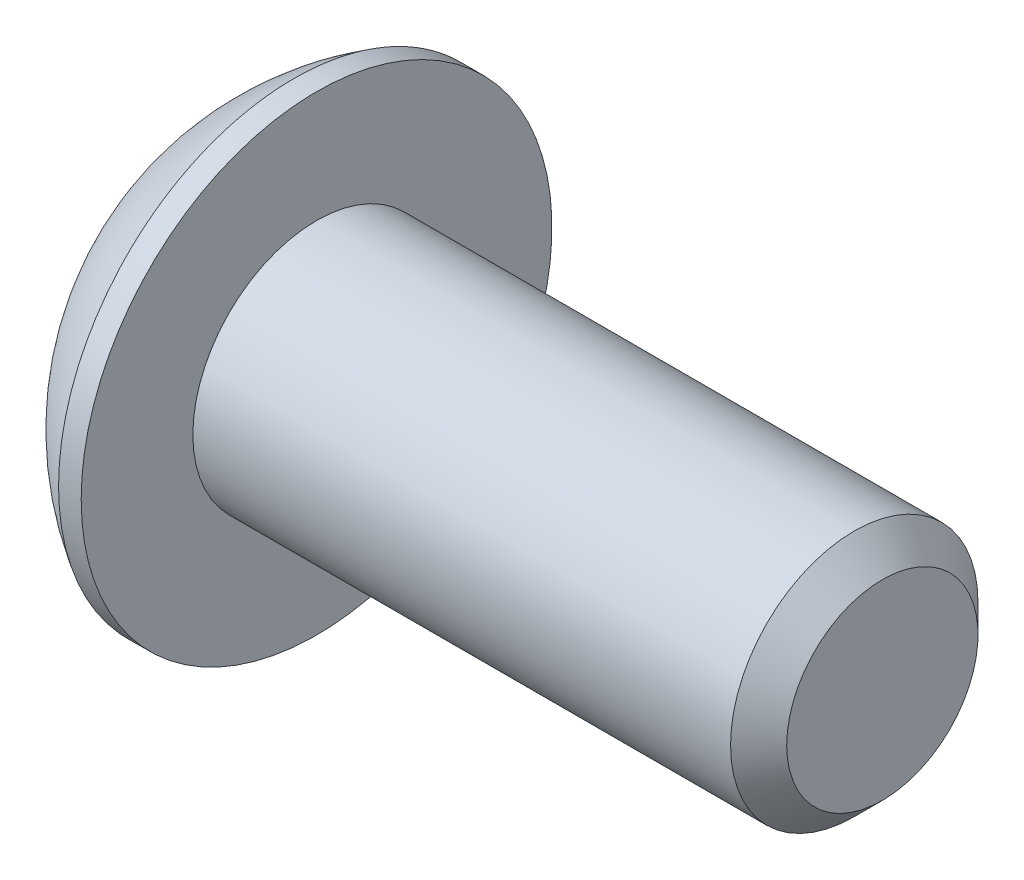
ISO-10303-21;
HEADER;
FILE_DESCRIPTION(('STEP AP214'),'2;1');
FILE_NAME('part.step','',(''),(''),'','','');
FILE_SCHEMA(('AUTOMOTIVE_DESIGN { 1 0 10303 214 1 1 1 1 }'));
ENDSEC;
DATA;
#1=APPLICATION_CONTEXT('core data for automotive mechanical design processes');
#2=APPLICATION_PROTOCOL_DEFINITION('international standard','automotive_design',2000,#1);
#3=PRODUCT_CONTEXT('',#1,'mechanical');
#4=PRODUCT('Part','Part','',(#3));
#5=PRODUCT_RELATED_PRODUCT_CATEGORY('part','',(#4));
#6=PRODUCT_DEFINITION_FORMATION('','',#4);
#7=PRODUCT_DEFINITION_CONTEXT('part definition',#1,'design');
#8=PRODUCT_DEFINITION('design','',#6,#7);
#9=PRODUCT_DEFINITION_SHAPE('','',#8);
#10=(LENGTH_UNIT() NAMED_UNIT(*) SI_UNIT(.MILLI.,.METRE.));
#11=(NAMED_UNIT(*) PLANE_ANGLE_UNIT() SI_UNIT($,.RADIAN.));
#12=(NAMED_UNIT(*) SI_UNIT($,.STERADIAN.) SOLID_ANGLE_UNIT());
#13=UNCERTAINTY_MEASURE_WITH_UNIT(LENGTH_MEASURE(1.E-05),#10,'distance_accuracy_value','');
#14=(GEOMETRIC_REPRESENTATION_CONTEXT(3) GLOBAL_UNCERTAINTY_ASSIGNED_CONTEXT((#13)) GLOBAL_UNIT_ASSIGNED_CONTEXT((#10,
#11,#12)) REPRESENTATION_CONTEXT('',''));
#15=CARTESIAN_POINT('',(0.,0.,0.));
#16=DIRECTION('',(0.,0.,1.));
#17=DIRECTION('',(1.,0.,0.));
#18=AXIS2_PLACEMENT_3D('',#15,#16,#17);
#19=CARTESIAN_POINT('',(1.32080000000034,0.,0.));
#20=DIRECTION('',(-1.,0.,0.));
#21=DIRECTION('',(0.,0.,1.));
#22=AXIS2_PLACEMENT_3D('',#19,#20,#21);
#23=CONICAL_SURFACE('',#22,1.1937999999998,1.04719755119608);
#24=CARTESIAN_POINT('',(2.01004075135902,0.,4.44089209850063E-13));
#25=VERTEX_POINT('',#24);
#26=VERTEX_LOOP('',#25);
#27=FACE_BOUND('',#26,.T.);
#28=CARTESIAN_POINT('',(1.32080000000009,0.,0.));
#29=DIRECTION('',(-1.,0.,0.));
#30=DIRECTION('',(0.,0.,1.));
#31=AXIS2_PLACEMENT_3D('',#28,#29,#30);
#32=CIRCLE('',#31,1.19380000000024);
#33=CARTESIAN_POINT('',(1.32080000000004,-1.03386112703797,0.59690000000006));
#34=VERTEX_POINT('',#33);
#35=CARTESIAN_POINT('',(1.32080000000004,0.,1.19380000000012));
#36=VERTEX_POINT('',#35);
#37=EDGE_CURVE('E19',#34,#36,#32,.T.);
#38=ORIENTED_EDGE('',*,*,#37,.T.);
#39=CARTESIAN_POINT('',(1.32080000000009,0.,0.));
#40=DIRECTION('',(-1.,0.,0.));
#41=DIRECTION('',(0.,0.,1.));
#42=AXIS2_PLACEMENT_3D('',#39,#40,#41);
#43=CIRCLE('',#42,1.19380000000024);
#44=CARTESIAN_POINT('',(1.32080000000004,1.03386112703797,0.596900000000061));
#45=VERTEX_POINT('',#44);
#46=EDGE_CURVE('E147',#36,#45,#43,.T.);
#47=ORIENTED_EDGE('',*,*,#46,.T.);
#48=CARTESIAN_POINT('',(1.32080000000009,0.,0.));
#49=DIRECTION('',(-1.,0.,0.));
#50=DIRECTION('',(0.,0.,1.));
#51=AXIS2_PLACEMENT_3D('',#48,#49,#50);
#52=CIRCLE('',#51,1.19380000000024);
#53=CARTESIAN_POINT('',(1.32080000000004,1.03386112703797,-0.596900000000061));
#54=VERTEX_POINT('',#53);
#55=EDGE_CURVE('E317',#45,#54,#52,.T.);
#56=ORIENTED_EDGE('',*,*,#55,.T.);
#57=CARTESIAN_POINT('',(1.32080000000009,0.,0.));
#58=DIRECTION('',(-1.,0.,0.));
#59=DIRECTION('',(0.,0.,1.));
#60=AXIS2_PLACEMENT_3D('',#57,#58,#59);
#61=CIRCLE('',#60,1.19380000000024);
#62=CARTESIAN_POINT('',(1.32080000000004,1.49457637585666E-12,-1.19380000000012));
#63=VERTEX_POINT('',#62);
#64=EDGE_CURVE('E318',#54,#63,#61,.T.);
#65=ORIENTED_EDGE('',*,*,#64,.T.);
#66=CARTESIAN_POINT('',(1.32080000000009,0.,0.));
#67=DIRECTION('',(-1.,0.,0.));
#68=DIRECTION('',(0.,0.,1.));
#69=AXIS2_PLACEMENT_3D('',#66,#67,#68);
#70=CIRCLE('',#69,1.19380000000024);
#71=CARTESIAN_POINT('',(1.32080000000004,-1.03386112703797,-0.59690000000006));
#72=VERTEX_POINT('',#71);
#73=EDGE_CURVE('E92',#63,#72,#70,.T.);
#74=ORIENTED_EDGE('',*,*,#73,.T.);
#75=CARTESIAN_POINT('',(1.32080000000009,0.,0.));
#76=DIRECTION('',(-1.,0.,0.));
#77=DIRECTION('',(0.,0.,1.));
#78=AXIS2_PLACEMENT_3D('',#75,#76,#77);
#79=CIRCLE('',#78,1.19380000000024);
#80=EDGE_CURVE('E88',#72,#34,#79,.T.);
#81=ORIENTED_EDGE('',*,*,#80,.T.);
#82=EDGE_LOOP('',(#38,#47,#56,#65,#74,#81));
#83=FACE_BOUND('',#82,.T.);
#84=ADVANCED_FACE('F16',(#27,#83),#23,.F.);
#85=CARTESIAN_POINT('',(1.3208,-2.06772225407572,-1.1938));
#86=DIRECTION('',(1.,0.,0.));
#87=DIRECTION('',(0.,0.,-1.));
#88=AXIS2_PLACEMENT_3D('',#85,#86,#87);
#89=PLANE('',#88);
#90=DIRECTION('',(0.,0.5,0.866025403784439));
#91=VECTOR('',#90,1.);
#92=CARTESIAN_POINT('',(1.3208,-1.37848150271715,0.));
#93=LINE('',#92,#91);
#94=CARTESIAN_POINT('',(1.3208,-0.689240751358574,1.1938));
#95=VERTEX_POINT('',#94);
#96=EDGE_CURVE('E100',#95,#34,#93,.F.);
#97=ORIENTED_EDGE('',*,*,#96,.F.);
#98=DIRECTION('',(0.,1.,0.));
#99=VECTOR('',#98,1.);
#100=CARTESIAN_POINT('',(1.3208,-0.689240751358574,1.1938));
#101=LINE('',#100,#99);
#102=EDGE_CURVE('E102',#36,#95,#101,.F.);
#103=ORIENTED_EDGE('',*,*,#102,.F.);
#104=ORIENTED_EDGE('',*,*,#37,.F.);
#105=EDGE_LOOP('',(#97,#103,#104));
#106=FACE_BOUND('',#105,.T.);
#107=ADVANCED_FACE('F98',(#106),#89,.F.);
#108=CARTESIAN_POINT('',(1.3208,-2.06772225407572,-1.1938));
#109=DIRECTION('',(1.,0.,0.));
#110=DIRECTION('',(0.,0.,-1.));
#111=AXIS2_PLACEMENT_3D('',#108,#109,#110);
#112=PLANE('',#111);
#113=DIRECTION('',(0.,-0.5,0.866025403784439));
#114=VECTOR('',#113,1.);
#115=CARTESIAN_POINT('',(1.3208,-0.689240751358574,-1.1938));
#116=LINE('',#115,#114);
#117=CARTESIAN_POINT('',(1.3208,-1.37848150271715,0.));
#118=VERTEX_POINT('',#117);
#119=EDGE_CURVE('E108',#118,#72,#116,.F.);
#120=ORIENTED_EDGE('',*,*,#119,.F.);
#121=DIRECTION('',(0.,0.5,0.866025403784439));
#122=VECTOR('',#121,1.);
#123=CARTESIAN_POINT('',(1.3208,-1.37848150271715,0.));
#124=LINE('',#123,#122);
#125=EDGE_CURVE('E105',#34,#118,#124,.F.);
#126=ORIENTED_EDGE('',*,*,#125,.F.);
#127=ORIENTED_EDGE('',*,*,#80,.F.);
#128=EDGE_LOOP('',(#120,#126,#127));
#129=FACE_BOUND('',#128,.T.);
#130=ADVANCED_FACE('F106',(#129),#112,.F.);
#131=CARTESIAN_POINT('',(1.3208,-2.06772225407572,-1.1938));
#132=DIRECTION('',(1.,0.,0.));
#133=DIRECTION('',(0.,0.,-1.));
#134=AXIS2_PLACEMENT_3D('',#131,#132,#133);
#135=PLANE('',#134);
#136=DIRECTION('',(0.,1.,0.));
#137=VECTOR('',#136,1.);
#138=CARTESIAN_POINT('',(1.3208,0.689240751358577,-1.1938));
#139=LINE('',#138,#137);
#140=CARTESIAN_POINT('',(1.3208,-0.689240751358574,-1.1938));
#141=VERTEX_POINT('',#140);
#142=EDGE_CURVE('E287',#141,#63,#139,.T.);
#143=ORIENTED_EDGE('',*,*,#142,.F.);
#144=DIRECTION('',(0.,-0.5,0.866025403784439));
#145=VECTOR('',#144,1.);
#146=CARTESIAN_POINT('',(1.3208,-0.689240751358574,-1.1938));
#147=LINE('',#146,#145);
#148=EDGE_CURVE('E299',#72,#141,#147,.F.);
#149=ORIENTED_EDGE('',*,*,#148,.F.);
#150=ORIENTED_EDGE('',*,*,#73,.F.);
#151=EDGE_LOOP('',(#143,#149,#150));
#152=FACE_BOUND('',#151,.T.);
#153=ADVANCED_FACE('F190',(#152),#135,.F.);
#154=CARTESIAN_POINT('',(1.3208,-2.06772225407572,-1.1938));
#155=DIRECTION('',(1.,0.,0.));
#156=DIRECTION('',(0.,0.,-1.));
#157=AXIS2_PLACEMENT_3D('',#154,#155,#156);
#158=PLANE('',#157);
#159=DIRECTION('',(0.,-0.5,-0.866025403784439));
#160=VECTOR('',#159,1.);
#161=CARTESIAN_POINT('',(1.3208,1.37848150271715,0.));
#162=LINE('',#161,#160);
#163=CARTESIAN_POINT('',(1.3208,0.689240751358577,-1.1938));
#164=VERTEX_POINT('',#163);
#165=EDGE_CURVE('E273',#164,#54,#162,.F.);
#166=ORIENTED_EDGE('',*,*,#165,.F.);
#167=DIRECTION('',(0.,1.,0.));
#168=VECTOR('',#167,1.);
#169=CARTESIAN_POINT('',(1.3208,0.689240751358577,-1.1938));
#170=LINE('',#169,#168);
#171=EDGE_CURVE('E284',#63,#164,#170,.T.);
#172=ORIENTED_EDGE('',*,*,#171,.F.);
#173=ORIENTED_EDGE('',*,*,#64,.F.);
#174=EDGE_LOOP('',(#166,#172,#173));
#175=FACE_BOUND('',#174,.T.);
#176=ADVANCED_FACE('F186',(#175),#158,.F.);
#177=CARTESIAN_POINT('',(1.3208,-2.06772225407572,-1.1938));
#178=DIRECTION('',(1.,0.,0.));
#179=DIRECTION('',(0.,0.,-1.));
#180=AXIS2_PLACEMENT_3D('',#177,#178,#179);
#181=PLANE('',#180);
#182=DIRECTION('',(0.,0.5,-0.866025403784439));
#183=VECTOR('',#182,1.);
#184=CARTESIAN_POINT('',(1.3208,0.689240751358576,1.1938));
#185=LINE('',#184,#183);
#186=CARTESIAN_POINT('',(1.3208,1.37848150271715,0.));
#187=VERTEX_POINT('',#186);
#188=EDGE_CURVE('E252',#187,#45,#185,.F.);
#189=ORIENTED_EDGE('',*,*,#188,.F.);
#190=DIRECTION('',(0.,-0.5,-0.866025403784439));
#191=VECTOR('',#190,1.);
#192=CARTESIAN_POINT('',(1.3208,1.37848150271715,0.));
#193=LINE('',#192,#191);
#194=EDGE_CURVE('E271',#54,#187,#193,.F.);
#195=ORIENTED_EDGE('',*,*,#194,.F.);
#196=ORIENTED_EDGE('',*,*,#55,.F.);
#197=EDGE_LOOP('',(#189,#195,#196));
#198=FACE_BOUND('',#197,.T.);
#199=ADVANCED_FACE('F182',(#198),#181,.F.);
#200=CARTESIAN_POINT('',(1.3208,-2.06772225407572,-1.1938));
#201=DIRECTION('',(1.,0.,0.));
#202=DIRECTION('',(0.,0.,-1.));
#203=AXIS2_PLACEMENT_3D('',#200,#201,#202);
#204=PLANE('',#203);
#205=DIRECTION('',(0.,1.,0.));
#206=VECTOR('',#205,1.);
#207=CARTESIAN_POINT('',(1.3208,-0.689240751358574,1.1938));
#208=LINE('',#207,#206);
#209=CARTESIAN_POINT('',(1.3208,0.689240751358576,1.1938));
#210=VERTEX_POINT('',#209);
#211=EDGE_CURVE('E117',#210,#36,#208,.F.);
#212=ORIENTED_EDGE('',*,*,#211,.F.);
#213=DIRECTION('',(0.,0.5,-0.866025403784439));
#214=VECTOR('',#213,1.);
#215=CARTESIAN_POINT('',(1.3208,0.689240751358576,1.1938));
#216=LINE('',#215,#214);
#217=EDGE_CURVE('E255',#45,#210,#216,.F.);
#218=ORIENTED_EDGE('',*,*,#217,.F.);
#219=ORIENTED_EDGE('',*,*,#46,.F.);
#220=EDGE_LOOP('',(#212,#218,#219));
#221=FACE_BOUND('',#220,.T.);
#222=ADVANCED_FACE('F178',(#221),#204,.F.);
#223=CARTESIAN_POINT('',(1.3208,-0.689240751358574,1.1938));
#224=DIRECTION('',(0.,0.,-1.));
#225=DIRECTION('',(0.,1.,0.));
#226=AXIS2_PLACEMENT_3D('',#223,#224,#225);
#227=PLANE('',#226);
#228=DIRECTION('',(0.,1.,0.));
#229=VECTOR('',#228,1.);
#230=CARTESIAN_POINT('',(0.,0.,1.1938));
#231=LINE('',#230,#229);
#232=CARTESIAN_POINT('',(0.,0.689240751358577,1.1938));
#233=VERTEX_POINT('',#232);
#234=CARTESIAN_POINT('',(0.,-0.689240751358574,1.1938));
#235=VERTEX_POINT('',#234);
#236=EDGE_CURVE('E249',#233,#235,#231,.F.);
#237=ORIENTED_EDGE('',*,*,#236,.F.);
#238=DIRECTION('',(1.,0.,0.));
#239=VECTOR('',#238,1.);
#240=CARTESIAN_POINT('',(1.3208,0.689240751358576,1.1938));
#241=LINE('',#240,#239);
#242=EDGE_CURVE('E261',#210,#233,#241,.F.);
#243=ORIENTED_EDGE('',*,*,#242,.F.);
#244=ORIENTED_EDGE('',*,*,#211,.T.);
#245=ORIENTED_EDGE('',*,*,#102,.T.);
#246=DIRECTION('',(1.,0.,0.));
#247=VECTOR('',#246,1.);
#248=CARTESIAN_POINT('',(1.3208,-0.689240751358574,1.1938));
#249=LINE('',#248,#247);
#250=EDGE_CURVE('E111',#235,#95,#249,.T.);
#251=ORIENTED_EDGE('',*,*,#250,.F.);
#252=EDGE_LOOP('',(#237,#243,#244,#245,#251));
#253=FACE_BOUND('',#252,.T.);
#254=ADVANCED_FACE('F175',(#253),#227,.T.);
#255=CARTESIAN_POINT('',(1.3208,-1.37848150271715,0.));
#256=DIRECTION('',(0.,0.866025403784439,-0.5));
#257=DIRECTION('',(0.,0.5,0.866025403784439));
#258=AXIS2_PLACEMENT_3D('',#255,#256,#257);
#259=PLANE('',#258);
#260=DIRECTION('',(0.,-0.5,-0.866025403784439));
#261=VECTOR('',#260,1.);
#262=CARTESIAN_POINT('',(0.,-0.689240751358574,1.1938));
#263=LINE('',#262,#261);
#264=CARTESIAN_POINT('',(0.,-1.37848150271715,0.));
#265=VERTEX_POINT('',#264);
#266=EDGE_CURVE('E246',#235,#265,#263,.T.);
#267=ORIENTED_EDGE('',*,*,#266,.F.);
#268=ORIENTED_EDGE('',*,*,#250,.T.);
#269=ORIENTED_EDGE('',*,*,#96,.T.);
#270=ORIENTED_EDGE('',*,*,#125,.T.);
#271=DIRECTION('',(1.,0.,0.));
#272=VECTOR('',#271,1.);
#273=CARTESIAN_POINT('',(1.3208,-1.37848150271715,0.));
#274=LINE('',#273,#272);
#275=EDGE_CURVE('E296',#265,#118,#274,.T.);
#276=ORIENTED_EDGE('',*,*,#275,.F.);
#277=EDGE_LOOP('',(#267,#268,#269,#270,#276));
#278=FACE_BOUND('',#277,.T.);
#279=ADVANCED_FACE('F115',(#278),#259,.T.);
#280=CARTESIAN_POINT('',(1.3208,-0.689240751358574,-1.1938));
#281=DIRECTION('',(0.,0.866025403784439,0.5));
#282=DIRECTION('',(0.,-0.5,0.866025403784439));
#283=AXIS2_PLACEMENT_3D('',#280,#281,#282);
#284=PLANE('',#283);
#285=DIRECTION('',(0.,0.5,-0.866025403784439));
#286=VECTOR('',#285,1.);
#287=CARTESIAN_POINT('',(0.,-1.37848150271715,0.));
#288=LINE('',#287,#286);
#289=CARTESIAN_POINT('',(0.,-0.689240751358574,-1.1938));
#290=VERTEX_POINT('',#289);
#291=EDGE_CURVE('E243',#265,#290,#288,.T.);
#292=ORIENTED_EDGE('',*,*,#291,.F.);
#293=ORIENTED_EDGE('',*,*,#275,.T.);
#294=ORIENTED_EDGE('',*,*,#119,.T.);
#295=ORIENTED_EDGE('',*,*,#148,.T.);
#296=DIRECTION('',(1.,0.,0.));
#297=VECTOR('',#296,1.);
#298=CARTESIAN_POINT('',(1.3208,-0.689240751358574,-1.1938));
#299=LINE('',#298,#297);
#300=EDGE_CURVE('E281',#290,#141,#299,.T.);
#301=ORIENTED_EDGE('',*,*,#300,.F.);
#302=EDGE_LOOP('',(#292,#293,#294,#295,#301));
#303=FACE_BOUND('',#302,.T.);
#304=ADVANCED_FACE('F168',(#303),#284,.T.);
#305=CARTESIAN_POINT('',(1.3208,0.689240751358577,-1.1938));
#306=DIRECTION('',(0.,0.,1.));
#307=DIRECTION('',(1.,0.,0.));
#308=AXIS2_PLACEMENT_3D('',#305,#306,#307);
#309=PLANE('',#308);
#310=DIRECTION('',(0.,1.,0.));
#311=VECTOR('',#310,1.);
#312=CARTESIAN_POINT('',(0.,0.,-1.1938));
#313=LINE('',#312,#311);
#314=CARTESIAN_POINT('',(0.,0.689240751358577,-1.1938));
#315=VERTEX_POINT('',#314);
#316=EDGE_CURVE('E240',#290,#315,#313,.T.);
#317=ORIENTED_EDGE('',*,*,#316,.F.);
#318=ORIENTED_EDGE('',*,*,#300,.T.);
#319=ORIENTED_EDGE('',*,*,#142,.T.);
#320=ORIENTED_EDGE('',*,*,#171,.T.);
#321=DIRECTION('',(1.,0.,0.));
#322=VECTOR('',#321,1.);
#323=CARTESIAN_POINT('',(1.3208,0.689240751358577,-1.1938));
#324=LINE('',#323,#322);
#325=EDGE_CURVE('E256',#315,#164,#324,.T.);
#326=ORIENTED_EDGE('',*,*,#325,.F.);
#327=EDGE_LOOP('',(#317,#318,#319,#320,#326));
#328=FACE_BOUND('',#327,.T.);
#329=ADVANCED_FACE('F165',(#328),#309,.T.);
#330=CARTESIAN_POINT('',(1.3208,1.37848150271715,0.));
#331=DIRECTION('',(0.,-0.866025403784439,0.5));
#332=DIRECTION('',(0.,-0.5,-0.866025403784439));
#333=AXIS2_PLACEMENT_3D('',#330,#331,#332);
#334=PLANE('',#333);
#335=DIRECTION('',(0.,0.5,0.866025403784439));
#336=VECTOR('',#335,1.);
#337=CARTESIAN_POINT('',(0.,0.689240751358577,-1.1938));
#338=LINE('',#337,#336);
#339=CARTESIAN_POINT('',(0.,1.37848150271715,0.));
#340=VERTEX_POINT('',#339);
#341=EDGE_CURVE('E237',#315,#340,#338,.T.);
#342=ORIENTED_EDGE('',*,*,#341,.F.);
#343=ORIENTED_EDGE('',*,*,#325,.T.);
#344=ORIENTED_EDGE('',*,*,#165,.T.);
#345=ORIENTED_EDGE('',*,*,#194,.T.);
#346=DIRECTION('',(1.,0.,0.));
#347=VECTOR('',#346,1.);
#348=CARTESIAN_POINT('',(1.3208,1.37848150271715,0.));
#349=LINE('',#348,#347);
#350=EDGE_CURVE('E34',#340,#187,#349,.T.);
#351=ORIENTED_EDGE('',*,*,#350,.F.);
#352=EDGE_LOOP('',(#342,#343,#344,#345,#351));
#353=FACE_BOUND('',#352,.T.);
#354=ADVANCED_FACE('F161',(#353),#334,.T.);
#355=CARTESIAN_POINT('',(1.3208,0.689240751358576,1.1938));
#356=DIRECTION('',(0.,-0.866025403784439,-0.5));
#357=DIRECTION('',(0.,0.5,-0.866025403784439));
#358=AXIS2_PLACEMENT_3D('',#355,#356,#357);
#359=PLANE('',#358);
#360=DIRECTION('',(0.,-0.5,0.866025403784439));
#361=VECTOR('',#360,1.);
#362=CARTESIAN_POINT('',(0.,1.37848150271715,0.));
#363=LINE('',#362,#361);
#364=EDGE_CURVE('E146',#340,#233,#363,.T.);
#365=ORIENTED_EDGE('',*,*,#364,.F.);
#366=ORIENTED_EDGE('',*,*,#350,.T.);
#367=ORIENTED_EDGE('',*,*,#188,.T.);
#368=ORIENTED_EDGE('',*,*,#217,.T.);
#369=ORIENTED_EDGE('',*,*,#242,.T.);
#370=EDGE_LOOP('',(#365,#366,#367,#368,#369));
#371=FACE_BOUND('',#370,.T.);
#372=ADVANCED_FACE('F157',(#371),#359,.T.);
#373=CARTESIAN_POINT('',(0.,0.,0.));
#374=DIRECTION('',(-1.,0.,0.));
#375=DIRECTION('',(0.,0.,1.));
#376=AXIS2_PLACEMENT_3D('',#373,#374,#375);
#377=PLANE('',#376);
#378=ORIENTED_EDGE('',*,*,#341,.T.);
#379=ORIENTED_EDGE('',*,*,#364,.T.);
#380=ORIENTED_EDGE('',*,*,#236,.T.);
#381=ORIENTED_EDGE('',*,*,#266,.T.);
#382=ORIENTED_EDGE('',*,*,#291,.T.);
#383=ORIENTED_EDGE('',*,*,#316,.T.);
#384=EDGE_LOOP('',(#378,#379,#380,#381,#382,#383));
#385=FACE_BOUND('',#384,.T.);
#386=CARTESIAN_POINT('',(0.,1.9812,0.));
#387=CARTESIAN_POINT('',(0.,1.9811996664299,0.0556258831179428));
#388=CARTESIAN_POINT('',(0.,1.97885520380442,0.111261989398606));
#389=CARTESIAN_POINT('',(0.,1.96949260169541,0.222149719830458));
#390=CARTESIAN_POINT('',(0.,1.96247308239605,0.277401225602895));
#391=CARTESIAN_POINT('',(0.,1.94379192841038,0.387209508139747));
#392=CARTESIAN_POINT('',(-1.85325793235264E-13,1.93212292489526,0.441765039546365));
#393=CARTESIAN_POINT('',(1.86344214223505E-13,1.90422331175315,0.549729449347493));
#394=CARTESIAN_POINT('',(6.94543371897454E-13,1.88798900035338,0.603137359208869));
#395=CARTESIAN_POINT('',(1.15501975216981E-12,1.83266214476501,0.760839131321828));
#396=CARTESIAN_POINT('',(0.,1.78690023648845,0.862876433575429));
#397=CARTESIAN_POINT('',(0.,1.67887358150667,1.05780719540872));
#398=CARTESIAN_POINT('',(9.54193214892627E-13,1.6166082074585,1.15070030720801));
#399=CARTESIAN_POINT('',(5.94805591894675E-13,1.51224157140982,1.28116890915697));
#400=CARTESIAN_POINT('',(1.63221293851378E-13,1.4755970394354,1.32320451127026));
#401=CARTESIAN_POINT('',(-1.62196980336157E-13,1.39893832619713,1.40400288695709));
#402=CARTESIAN_POINT('',(0.,1.35892742784698,1.44276877695455));
#403=CARTESIAN_POINT('',(1.14362537325405E-13,1.23416504602197,1.55382272417904));
#404=CARTESIAN_POINT('',(0.,1.14466125559859,1.62089527952111));
#405=CARTESIAN_POINT('',(0.,0.955712144178167,1.7390221808118));
#406=CARTESIAN_POINT('',(0.,0.856267198233564,1.79007713076007));
#407=CARTESIAN_POINT('',(0.,0.650206345910843,1.87477637530954));
#408=CARTESIAN_POINT('',(0.,0.543590516134855,1.90842085586267));
#409=CARTESIAN_POINT('',(0.,0.326226155292018,1.95733039300656));
#410=CARTESIAN_POINT('',(0.,0.21547760215793,1.97259535144288));
#411=CARTESIAN_POINT('',(0.,-0.00701040587544639,1.98431697865418));
#412=CARTESIAN_POINT('',(0.,-0.118749860774734,1.98077364742917));
#413=CARTESIAN_POINT('',(0.,-0.340050178355485,1.95497485623825));
#414=CARTESIAN_POINT('',(0.,-0.449611052668255,1.93271949620218));
#415=CARTESIAN_POINT('',(0.,-0.663431110729174,1.87014138774523));
#416=CARTESIAN_POINT('',(0.,-0.76769023783852,1.82981844635272));
#417=CARTESIAN_POINT('',(0.,-0.968005760719347,1.73219968377096));
#418=CARTESIAN_POINT('',(0.,-1.0640618469811,1.6749032225164));
#419=CARTESIAN_POINT('',(0.,-1.19980276751283,1.57757371205873));
#420=CARTESIAN_POINT('',(0.,-1.24366557129213,1.54322665019466));
#421=CARTESIAN_POINT('',(0.,-1.32838995706696,1.47093063174264));
#422=CARTESIAN_POINT('',(0.,-1.36924860178706,1.43297823102439));
#423=CARTESIAN_POINT('',(0.,-1.48674671849223,1.31419842051173));
#424=CARTESIAN_POINT('',(0.,-1.55842832343237,1.22836221289311));
#425=CARTESIAN_POINT('',(0.,-1.6863396856475,1.04586168272493));
#426=CARTESIAN_POINT('',(0.,-1.7425700302488,0.949197771949774));
#427=CARTESIAN_POINT('',(0.,-1.8141614250401,0.798182600298684));
#428=CARTESIAN_POINT('',(0.,-1.83591780585875,0.746776203847791));
#429=CARTESIAN_POINT('',(0.,-1.87500754181092,0.642341081688636));
#430=CARTESIAN_POINT('',(0.,-1.89234447645404,0.589313708122847));
#431=CARTESIAN_POINT('',(0.,-1.92246053433554,0.482076273028395));
#432=CARTESIAN_POINT('',(0.,-1.93524685475118,0.42786822425751));
#433=CARTESIAN_POINT('',(0.,-1.95620937250494,0.318578151844611));
#434=CARTESIAN_POINT('',(0.,-1.96438692958147,0.263496390912872));
#435=CARTESIAN_POINT('',(0.,-1.97388528284653,0.173607715038558));
#436=CARTESIAN_POINT('',(0.,-1.97662743364426,0.138944718024998));
#437=CARTESIAN_POINT('',(0.,-1.98028489645283,0.0695224782567002));
#438=CARTESIAN_POINT('',(0.,-1.98120020846367,0.0347632355019631));
#439=CARTESIAN_POINT('',(0.,-1.9811996664299,-0.0556258831179437));
#440=CARTESIAN_POINT('',(0.,-1.97885520380442,-0.111261989398607));
#441=CARTESIAN_POINT('',(0.,-1.96949260169541,-0.222149719830459));
#442=CARTESIAN_POINT('',(0.,-1.96247308239605,-0.277401225602897));
#443=CARTESIAN_POINT('',(0.,-1.94379192841039,-0.387209508139749));
#444=CARTESIAN_POINT('',(-1.85269749640691E-13,-1.93212292489526,-0.441765039546367));
#445=CARTESIAN_POINT('',(1.86288125054388E-13,-1.90422331175315,-0.549729449347495));
#446=CARTESIAN_POINT('',(6.94525090263764E-13,-1.88798900035338,-0.603137359208872));
#447=CARTESIAN_POINT('',(1.15505622829081E-12,-1.83266214476501,-0.760839131321831));
#448=CARTESIAN_POINT('',(0.,-1.78690023648845,-0.862876433575431));
#449=CARTESIAN_POINT('',(0.,-1.67887358150667,-1.05780719540872));
#450=CARTESIAN_POINT('',(9.54248812869379E-13,-1.6166082074585,-1.15070030720801));
#451=CARTESIAN_POINT('',(5.94777756479239E-13,-1.51224157140982,-1.28116890915698));
#452=CARTESIAN_POINT('',(1.63138949183833E-13,-1.47559703943539,-1.32320451127027));
#453=CARTESIAN_POINT('',(-1.62114715061273E-13,-1.39893832619713,-1.40400288695709));
#454=CARTESIAN_POINT('',(0.,-1.35892742784699,-1.44276877695455));
#455=CARTESIAN_POINT('',(1.13760489124207E-13,-1.23416504602197,-1.55382272417904));
#456=CARTESIAN_POINT('',(0.,-1.14466125559859,-1.62089527952111));
#457=CARTESIAN_POINT('',(0.,-0.95571214417816,-1.73902218081179));
#458=CARTESIAN_POINT('',(0.,-0.856267198233559,-1.79007713076007));
#459=CARTESIAN_POINT('',(0.,-0.650206345910841,-1.87477637530954));
#460=CARTESIAN_POINT('',(0.,-0.543590516134854,-1.90842085586267));
#461=CARTESIAN_POINT('',(0.,-0.326226155292018,-1.95733039300657));
#462=CARTESIAN_POINT('',(0.,-0.215477602157929,-1.97259535144288));
#463=CARTESIAN_POINT('',(0.,0.0070104058754487,-1.98431697865418));
#464=CARTESIAN_POINT('',(0.,0.118749860774737,-1.98077364742916));
#465=CARTESIAN_POINT('',(0.,0.340050178355489,-1.95497485623824));
#466=CARTESIAN_POINT('',(0.,0.44961105266826,-1.93271949620218));
#467=CARTESIAN_POINT('',(0.,0.663431110729178,-1.87014138774524));
#468=CARTESIAN_POINT('',(0.,0.767690237838524,-1.82981844635272));
#469=CARTESIAN_POINT('',(0.,0.968005760719348,-1.73219968377096));
#470=CARTESIAN_POINT('',(0.,1.0640618469811,-1.67490322251639));
#471=CARTESIAN_POINT('',(0.,1.19980276751283,-1.57757371205873));
#472=CARTESIAN_POINT('',(0.,1.24366557129214,-1.54322665019465));
#473=CARTESIAN_POINT('',(0.,1.32838995706696,-1.47093063174263));
#474=CARTESIAN_POINT('',(0.,1.36924860178706,-1.43297823102439));
#475=CARTESIAN_POINT('',(0.,1.48674671849223,-1.31419842051172));
#476=CARTESIAN_POINT('',(0.,1.55842832343237,-1.22836221289311));
#477=CARTESIAN_POINT('',(0.,1.6863396856475,-1.04586168272492));
#478=CARTESIAN_POINT('',(0.,1.7425700302488,-0.949197771949768));
#479=CARTESIAN_POINT('',(0.,1.8141614250401,-0.798182600298677));
#480=CARTESIAN_POINT('',(0.,1.83591780585875,-0.746776203847785));
#481=CARTESIAN_POINT('',(0.,1.87500754181092,-0.64234108168863));
#482=CARTESIAN_POINT('',(0.,1.89234447645404,-0.589313708122841));
#483=CARTESIAN_POINT('',(0.,1.92246053433555,-0.482076273028389));
#484=CARTESIAN_POINT('',(0.,1.93524685475118,-0.427868224257505));
#485=CARTESIAN_POINT('',(0.,1.95620937250494,-0.318578151844605));
#486=CARTESIAN_POINT('',(0.,1.96438692958147,-0.263496390912866));
#487=CARTESIAN_POINT('',(0.,1.97388528284653,-0.173607715038553));
#488=CARTESIAN_POINT('',(0.,1.97662743364426,-0.138944718024994));
#489=CARTESIAN_POINT('',(0.,1.98028489645283,-0.0695224782566989));
#490=CARTESIAN_POINT('',(0.,1.98120020846367,-0.034763235501963));
#491=CARTESIAN_POINT('',(0.,1.9812,0.));
#492=B_SPLINE_CURVE_WITH_KNOTS('',3,(#386,#387,#388,#389,#390,#391,#392,#393,#394,#395,#396,
#397,#398,#399,#400,#401,#402,#403,#404,#405,#406,#407,#408,#409,#410,#411,#412,#413,#414,#415,
#416,#417,#418,#419,#420,#421,#422,#423,#424,#425,#426,#427,#428,#429,#430,#431,#432,#433,#434,
#435,#436,#437,#438,#439,#440,#441,#442,#443,#444,#445,#446,#447,#448,#449,#450,#451,#452,#453,
#454,#455,#456,#457,#458,#459,#460,#461,#462,#463,#464,#465,#466,#467,#468,#469,#470,#471,#472,
#473,#474,#475,#476,#477,#478,#479,#480,#481,#482,#483,#484,#485,#486,#487,#488,#489,#490,#491),
.UNSPECIFIED.,.T.,.F.,(4,2,2,2,2,2,2,2,2,2,2,2,2,2,2,2,2,2,2,2,2,2,2,2,2,2,2,2,2,2,2,2,2,2,2,2,
2,2,2,2,2,2,2,2,2,2,2,2,2,2,2,2,4),(0.,0.166845646007828,0.333740557374255,0.500901034367693,
0.668197445942386,1.00199278686282,1.33580081809885,1.50292354032982,1.6698851310853,
2.00370118900129,2.33750465770544,2.67130456115909,3.005106247238,3.33890793331696,
3.67270783677065,4.00651130547476,4.34032736339026,4.50728895414554,4.67441167637632,
5.00821970761259,5.34201504853332,5.50931146010827,5.67647193710191,5.84336684846844,
6.0102124944764,6.11448220058334,6.21875190669029,6.38559755269812,6.55249246406454,
6.71965294105798,6.88694935263268,7.22074469355311,7.55455272478915,7.72167544702011,
7.88863703777559,8.22245309569158,8.55625656439573,8.89005646784938,9.2238581539283,
9.55765984000725,9.89145974346094,10.2252632121651,10.5590792700806,10.7260408608358,
10.8931635830666,11.2269716143029,11.5607669552236,11.7280633667986,11.8952238437922,
12.0621187551587,12.2289644011667,12.3332341072736,12.4375038133806),.UNSPECIFIED.);
#493=CARTESIAN_POINT('',(0.,1.9812,0.));
#494=VERTEX_POINT('',#493);
#495=EDGE_CURVE('E139',#494,#494,#492,.T.);
#496=ORIENTED_EDGE('',*,*,#495,.F.);
#497=EDGE_LOOP('',(#496));
#498=FACE_BOUND('',#497,.T.);
#499=ADVANCED_FACE('F153',(#385,#498),#377,.T.);
#500=CARTESIAN_POINT('',(4.13385,0.,0.));
#501=DIRECTION('',(0.,1.,0.));
#502=DIRECTION('',(1.,0.,0.));
#503=AXIS2_PLACEMENT_3D('',#500,#501,#502);
#504=SPHERICAL_SURFACE('',#503,4.58408870578439);
#505=CARTESIAN_POINT('',(1.8288,0.,0.));
#506=DIRECTION('',(-1.,0.,0.));
#507=DIRECTION('',(0.,0.,1.));
#508=AXIS2_PLACEMENT_3D('',#505,#506,#507);
#509=CIRCLE('',#508,3.9624);
#510=CARTESIAN_POINT('',(1.8288,0.,3.9624));
#511=VERTEX_POINT('',#510);
#512=EDGE_CURVE('E136',#511,#511,#509,.F.);
#513=ORIENTED_EDGE('',*,*,#512,.F.);
#514=EDGE_LOOP('',(#513));
#515=FACE_BOUND('',#514,.T.);
#516=ORIENTED_EDGE('',*,*,#495,.T.);
#517=EDGE_LOOP('',(#516));
#518=FACE_BOUND('',#517,.T.);
#519=ADVANCED_FACE('F149',(#515,#518),#504,.T.);
#520=CARTESIAN_POINT('',(11.7348,0.,0.));
#521=DIRECTION('',(-1.,0.,0.));
#522=DIRECTION('',(0.,0.,1.));
#523=AXIS2_PLACEMENT_3D('',#520,#521,#522);
#524=PLANE('',#523);
#525=CARTESIAN_POINT('',(11.7347999999424,0.,0.));
#526=DIRECTION('',(-1.,0.,0.));
#527=DIRECTION('',(0.,0.,1.));
#528=AXIS2_PLACEMENT_3D('',#525,#526,#527);
#529=CIRCLE('',#528,1.61036000002923);
#530=CARTESIAN_POINT('',(11.7347999999424,0.,1.61036000002923));
#531=VERTEX_POINT('',#530);
#532=EDGE_CURVE('E133',#531,#531,#529,.T.);
#533=ORIENTED_EDGE('',*,*,#532,.F.);
#534=EDGE_LOOP('',(#533));
#535=FACE_BOUND('',#534,.T.);
#536=ADVANCED_FACE('F221',(#535),#524,.F.);
#537=CARTESIAN_POINT('',(0.,0.,0.));
#538=DIRECTION('',(-1.,0.,0.));
#539=DIRECTION('',(0.,0.,1.));
#540=AXIS2_PLACEMENT_3D('',#537,#538,#539);
#541=CYLINDRICAL_SURFACE('',#540,3.9624);
#542=ORIENTED_EDGE('',*,*,#512,.T.);
#543=EDGE_LOOP('',(#542));
#544=FACE_BOUND('',#543,.T.);
#545=CARTESIAN_POINT('',(2.2098,0.,0.));
#546=DIRECTION('',(-1.,0.,0.));
#547=DIRECTION('',(0.,0.,1.));
#548=AXIS2_PLACEMENT_3D('',#545,#546,#547);
#549=CIRCLE('',#548,3.9624);
#550=CARTESIAN_POINT('',(2.2098,0.,3.9624));
#551=VERTEX_POINT('',#550);
#552=EDGE_CURVE('E130',#551,#551,#549,.T.);
#553=ORIENTED_EDGE('',*,*,#552,.T.);
#554=EDGE_LOOP('',(#553));
#555=FACE_BOUND('',#554,.T.);
#556=ADVANCED_FACE('F218',(#544,#555),#541,.T.);
#557=CARTESIAN_POINT('',(11.2623600000461,0.,0.));
#558=DIRECTION('',(-1.,0.,0.));
#559=DIRECTION('',(0.,0.,1.));
#560=AXIS2_PLACEMENT_3D('',#557,#558,#559);
#561=CONICAL_SURFACE('',#560,2.08279999992556,0.785398163397448);
#562=ORIENTED_EDGE('',*,*,#532,.T.);
#563=EDGE_LOOP('',(#562));
#564=FACE_BOUND('',#563,.T.);
#565=CARTESIAN_POINT('',(11.26236,0.,0.));
#566=DIRECTION('',(-1.,0.,0.));
#567=DIRECTION('',(0.,0.,1.));
#568=AXIS2_PLACEMENT_3D('',#565,#566,#567);
#569=CIRCLE('',#568,2.0828);
#570=CARTESIAN_POINT('',(11.26236,0.,2.0828));
#571=VERTEX_POINT('',#570);
#572=EDGE_CURVE('E25',#571,#571,#569,.T.);
#573=ORIENTED_EDGE('',*,*,#572,.F.);
#574=EDGE_LOOP('',(#573));
#575=FACE_BOUND('',#574,.T.);
#576=ADVANCED_FACE('F210',(#564,#575),#561,.T.);
#577=CARTESIAN_POINT('',(2.2098,2.0828,0.));
#578=DIRECTION('',(-1.,0.,0.));
#579=DIRECTION('',(0.,0.,1.));
#580=AXIS2_PLACEMENT_3D('',#577,#578,#579);
#581=PLANE('',#580);
#582=CARTESIAN_POINT('',(2.2098,0.,0.));
#583=DIRECTION('',(-1.,0.,0.));
#584=DIRECTION('',(0.,0.,1.));
#585=AXIS2_PLACEMENT_3D('',#582,#583,#584);
#586=CIRCLE('',#585,2.0828);
#587=CARTESIAN_POINT('',(2.2098,0.,2.0828));
#588=VERTEX_POINT('',#587);
#589=EDGE_CURVE('E10',#588,#588,#586,.F.);
#590=ORIENTED_EDGE('',*,*,#589,.F.);
#591=EDGE_LOOP('',(#590));
#592=FACE_BOUND('',#591,.T.);
#593=ORIENTED_EDGE('',*,*,#552,.F.);
#594=EDGE_LOOP('',(#593));
#595=FACE_BOUND('',#594,.T.);
#596=ADVANCED_FACE('F204',(#592,#595),#581,.F.);
#597=CARTESIAN_POINT('',(0.,0.,0.));
#598=DIRECTION('',(-1.,0.,0.));
#599=DIRECTION('',(0.,0.,1.));
#600=AXIS2_PLACEMENT_3D('',#597,#598,#599);
#601=CYLINDRICAL_SURFACE('',#600,2.0828);
#602=ORIENTED_EDGE('',*,*,#572,.T.);
#603=EDGE_LOOP('',(#602));
#604=FACE_BOUND('',#603,.T.);
#605=ORIENTED_EDGE('',*,*,#589,.T.);
#606=EDGE_LOOP('',(#605));
#607=FACE_BOUND('',#606,.T.);
#608=ADVANCED_FACE('F202',(#604,#607),#601,.T.);
#609=CLOSED_SHELL('',(#84,#107,#130,#153,#176,#199,#222,#254,#279,#304,#329,#354,#372,#499,#519,
#536,#556,#576,#596,#608));
#610=MANIFOLD_SOLID_BREP('B1',#609);
#611=ADVANCED_BREP_SHAPE_REPRESENTATION('',(#18,#610),#14);
#612=SHAPE_DEFINITION_REPRESENTATION(#9,#611);
ENDSEC;
END-ISO-10303-21;
